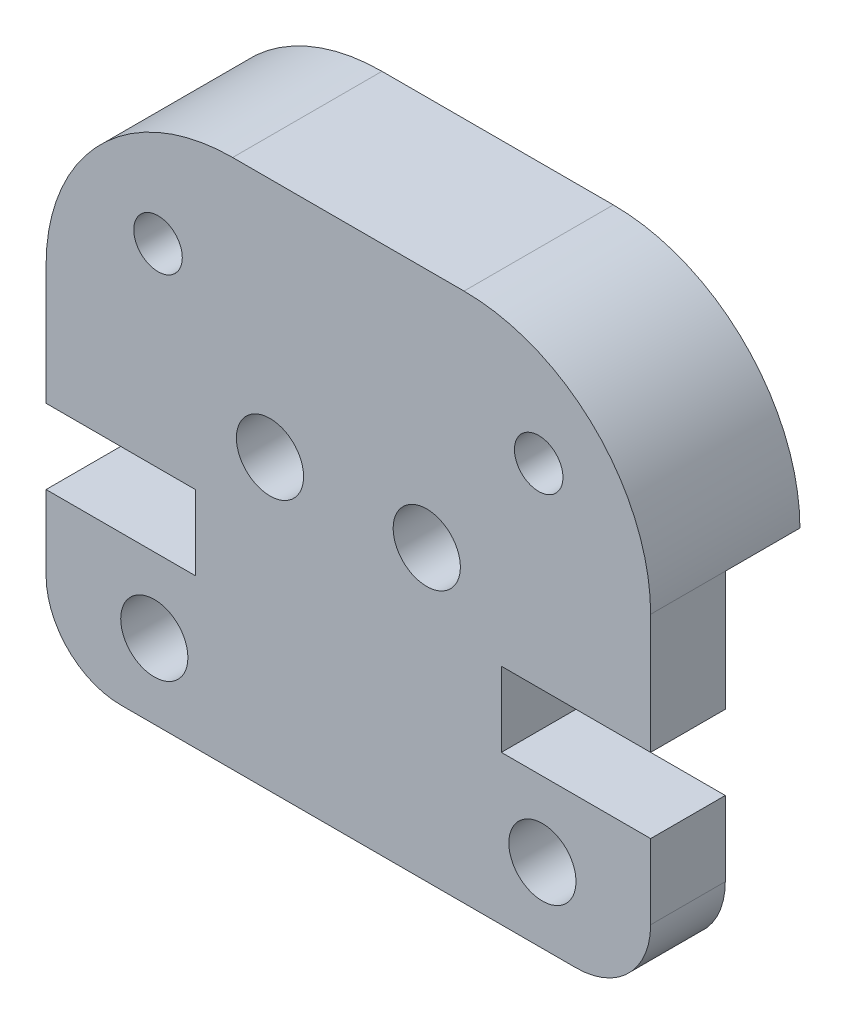
ISO-10303-21;
HEADER;
FILE_DESCRIPTION(('STEP AP214'),'2;1');
FILE_NAME('part.step','',(''),(''),'','','');
FILE_SCHEMA(('AUTOMOTIVE_DESIGN { 1 0 10303 214 1 1 1 1 }'));
ENDSEC;
DATA;
#1=APPLICATION_CONTEXT('core data for automotive mechanical design processes');
#2=APPLICATION_PROTOCOL_DEFINITION('international standard','automotive_design',2000,#1);
#3=PRODUCT_CONTEXT('',#1,'mechanical');
#4=PRODUCT('Part','Part','',(#3));
#5=PRODUCT_RELATED_PRODUCT_CATEGORY('part','',(#4));
#6=PRODUCT_DEFINITION_FORMATION('','',#4);
#7=PRODUCT_DEFINITION_CONTEXT('part definition',#1,'design');
#8=PRODUCT_DEFINITION('design','',#6,#7);
#9=PRODUCT_DEFINITION_SHAPE('','',#8);
#10=(LENGTH_UNIT() NAMED_UNIT(*) SI_UNIT(.MILLI.,.METRE.));
#11=(NAMED_UNIT(*) PLANE_ANGLE_UNIT() SI_UNIT($,.RADIAN.));
#12=(NAMED_UNIT(*) SI_UNIT($,.STERADIAN.) SOLID_ANGLE_UNIT());
#13=UNCERTAINTY_MEASURE_WITH_UNIT(LENGTH_MEASURE(1.E-05),#10,'distance_accuracy_value','');
#14=(GEOMETRIC_REPRESENTATION_CONTEXT(3) GLOBAL_UNCERTAINTY_ASSIGNED_CONTEXT((#13)) GLOBAL_UNIT_ASSIGNED_CONTEXT((#10,
#11,#12)) REPRESENTATION_CONTEXT('',''));
#15=CARTESIAN_POINT('',(0.,0.,0.));
#16=DIRECTION('',(0.,0.,1.));
#17=DIRECTION('',(1.,0.,0.));
#18=AXIS2_PLACEMENT_3D('',#15,#16,#17);
#19=CARTESIAN_POINT('',(14.2,2.00000000000002,4.));
#20=DIRECTION('',(0.,0.,-1.));
#21=DIRECTION('',(-1.,0.,0.));
#22=AXIS2_PLACEMENT_3D('',#19,#20,#21);
#23=CYLINDRICAL_SURFACE('',#22,2.00000000000001);
#24=CARTESIAN_POINT('',(14.2,2.00000000000002,2.));
#25=DIRECTION('',(0.,0.,-1.));
#26=DIRECTION('',(-1.,0.,0.));
#27=AXIS2_PLACEMENT_3D('',#24,#25,#26);
#28=CIRCLE('',#27,2.00000000000001);
#29=CARTESIAN_POINT('',(16.2,2.00000000000002,2.));
#30=VERTEX_POINT('',#29);
#31=CARTESIAN_POINT('',(14.2,0.,2.));
#32=VERTEX_POINT('',#31);
#33=EDGE_CURVE('E48',#30,#32,#28,.T.);
#34=ORIENTED_EDGE('',*,*,#33,.F.);
#35=DIRECTION('',(0.,0.,-1.));
#36=VECTOR('',#35,1.);
#37=CARTESIAN_POINT('',(16.2,2.00000000000002,4.));
#38=LINE('',#37,#36);
#39=CARTESIAN_POINT('',(16.2,2.00000000000002,4.));
#40=VERTEX_POINT('',#39);
#41=EDGE_CURVE('E11',#40,#30,#38,.T.);
#42=ORIENTED_EDGE('',*,*,#41,.F.);
#43=CARTESIAN_POINT('',(14.2,2.00000000000002,4.));
#44=DIRECTION('',(0.,0.,1.));
#45=DIRECTION('',(-1.,0.,0.));
#46=AXIS2_PLACEMENT_3D('',#43,#44,#45);
#47=CIRCLE('',#46,2.00000000000001);
#48=CARTESIAN_POINT('',(14.2,0.,4.));
#49=VERTEX_POINT('',#48);
#50=EDGE_CURVE('E159',#49,#40,#47,.T.);
#51=ORIENTED_EDGE('',*,*,#50,.F.);
#52=DIRECTION('',(0.,0.,-1.));
#53=VECTOR('',#52,1.);
#54=CARTESIAN_POINT('',(14.2,0.,4.));
#55=LINE('',#54,#53);
#56=EDGE_CURVE('E148',#49,#32,#55,.T.);
#57=ORIENTED_EDGE('',*,*,#56,.T.);
#58=EDGE_LOOP('',(#34,#42,#51,#57));
#59=FACE_BOUND('',#58,.T.);
#60=ADVANCED_FACE('F33',(#59),#23,.T.);
#61=CARTESIAN_POINT('',(16.2,2.00000000000002,4.));
#62=DIRECTION('',(-1.,0.,0.));
#63=DIRECTION('',(0.,0.,1.));
#64=AXIS2_PLACEMENT_3D('',#61,#62,#63);
#65=PLANE('',#64);
#66=DIRECTION('',(0.,-1.,0.));
#67=VECTOR('',#66,1.);
#68=CARTESIAN_POINT('',(16.2,9.205,2.));
#69=LINE('',#68,#67);
#70=CARTESIAN_POINT('',(16.2,4.00000000000002,2.));
#71=VERTEX_POINT('',#70);
#72=EDGE_CURVE('E207',#71,#30,#69,.T.);
#73=ORIENTED_EDGE('',*,*,#72,.F.);
#74=DIRECTION('',(0.,0.,-1.));
#75=VECTOR('',#74,1.);
#76=CARTESIAN_POINT('',(16.2,4.00000000000002,4.));
#77=LINE('',#76,#75);
#78=CARTESIAN_POINT('',(16.2,4.00000000000002,4.));
#79=VERTEX_POINT('',#78);
#80=EDGE_CURVE('E41',#79,#71,#77,.T.);
#81=ORIENTED_EDGE('',*,*,#80,.F.);
#82=DIRECTION('',(0.,1.,0.));
#83=VECTOR('',#82,1.);
#84=CARTESIAN_POINT('',(16.2,2.00000000000002,4.));
#85=LINE('',#84,#83);
#86=EDGE_CURVE('E81',#40,#79,#85,.T.);
#87=ORIENTED_EDGE('',*,*,#86,.F.);
#88=ORIENTED_EDGE('',*,*,#41,.T.);
#89=EDGE_LOOP('',(#73,#81,#87,#88));
#90=FACE_BOUND('',#89,.T.);
#91=ADVANCED_FACE('F206',(#90),#65,.F.);
#92=CARTESIAN_POINT('',(12.2,4.00000000000002,4.));
#93=DIRECTION('',(0.,-1.,0.));
#94=DIRECTION('',(1.,0.,0.));
#95=AXIS2_PLACEMENT_3D('',#92,#93,#94);
#96=PLANE('',#95);
#97=DIRECTION('',(1.,0.,0.));
#98=VECTOR('',#97,1.);
#99=CARTESIAN_POINT('',(12.2,4.00000000000002,2.));
#100=LINE('',#99,#98);
#101=CARTESIAN_POINT('',(12.2,4.00000000000002,2.));
#102=VERTEX_POINT('',#101);
#103=EDGE_CURVE('E200',#102,#71,#100,.T.);
#104=ORIENTED_EDGE('',*,*,#103,.F.);
#105=DIRECTION('',(0.,0.,-1.));
#106=VECTOR('',#105,1.);
#107=CARTESIAN_POINT('',(12.2,4.00000000000002,4.));
#108=LINE('',#107,#106);
#109=CARTESIAN_POINT('',(12.2,4.00000000000002,4.));
#110=VERTEX_POINT('',#109);
#111=EDGE_CURVE('E189',#110,#102,#108,.T.);
#112=ORIENTED_EDGE('',*,*,#111,.F.);
#113=DIRECTION('',(-1.,0.,0.));
#114=VECTOR('',#113,1.);
#115=CARTESIAN_POINT('',(12.2,4.00000000000002,4.));
#116=LINE('',#115,#114);
#117=EDGE_CURVE('E201',#79,#110,#116,.T.);
#118=ORIENTED_EDGE('',*,*,#117,.F.);
#119=ORIENTED_EDGE('',*,*,#80,.T.);
#120=EDGE_LOOP('',(#104,#112,#118,#119));
#121=FACE_BOUND('',#120,.T.);
#122=ADVANCED_FACE('F197',(#121),#96,.F.);
#123=CARTESIAN_POINT('',(12.2,6.00000000000003,4.));
#124=DIRECTION('',(-1.,0.,0.));
#125=DIRECTION('',(0.,-1.,0.));
#126=AXIS2_PLACEMENT_3D('',#123,#124,#125);
#127=PLANE('',#126);
#128=DIRECTION('',(0.,-1.,0.));
#129=VECTOR('',#128,1.);
#130=CARTESIAN_POINT('',(12.2,6.00000000000003,2.));
#131=LINE('',#130,#129);
#132=CARTESIAN_POINT('',(12.2,6.00000000000003,2.));
#133=VERTEX_POINT('',#132);
#134=EDGE_CURVE('E251',#133,#102,#131,.T.);
#135=ORIENTED_EDGE('',*,*,#134,.F.);
#136=DIRECTION('',(0.,0.,-1.));
#137=VECTOR('',#136,1.);
#138=CARTESIAN_POINT('',(12.2,6.00000000000003,4.));
#139=LINE('',#138,#137);
#140=CARTESIAN_POINT('',(12.2,6.00000000000003,4.));
#141=VERTEX_POINT('',#140);
#142=EDGE_CURVE('E186',#141,#133,#139,.T.);
#143=ORIENTED_EDGE('',*,*,#142,.F.);
#144=DIRECTION('',(0.,1.,0.));
#145=VECTOR('',#144,1.);
#146=CARTESIAN_POINT('',(12.2,6.00000000000003,4.));
#147=LINE('',#146,#145);
#148=EDGE_CURVE('E282',#110,#141,#147,.T.);
#149=ORIENTED_EDGE('',*,*,#148,.F.);
#150=ORIENTED_EDGE('',*,*,#111,.T.);
#151=EDGE_LOOP('',(#135,#143,#149,#150));
#152=FACE_BOUND('',#151,.T.);
#153=ADVANCED_FACE('F325',(#152),#127,.F.);
#154=CARTESIAN_POINT('',(16.2,6.00000000000003,4.));
#155=DIRECTION('',(0.,1.,0.));
#156=DIRECTION('',(-1.,0.,0.));
#157=AXIS2_PLACEMENT_3D('',#154,#155,#156);
#158=PLANE('',#157);
#159=DIRECTION('',(-1.,0.,0.));
#160=VECTOR('',#159,1.);
#161=CARTESIAN_POINT('',(16.2,6.00000000000003,2.));
#162=LINE('',#161,#160);
#163=CARTESIAN_POINT('',(16.2,6.00000000000003,2.));
#164=VERTEX_POINT('',#163);
#165=EDGE_CURVE('E248',#164,#133,#162,.T.);
#166=ORIENTED_EDGE('',*,*,#165,.F.);
#167=DIRECTION('',(0.,0.,-1.));
#168=VECTOR('',#167,1.);
#169=CARTESIAN_POINT('',(16.2,6.00000000000003,4.));
#170=LINE('',#169,#168);
#171=CARTESIAN_POINT('',(16.2,6.00000000000003,4.));
#172=VERTEX_POINT('',#171);
#173=EDGE_CURVE('E183',#172,#164,#170,.T.);
#174=ORIENTED_EDGE('',*,*,#173,.F.);
#175=DIRECTION('',(1.,0.,0.));
#176=VECTOR('',#175,1.);
#177=CARTESIAN_POINT('',(16.2,6.00000000000003,4.));
#178=LINE('',#177,#176);
#179=EDGE_CURVE('E284',#141,#172,#178,.T.);
#180=ORIENTED_EDGE('',*,*,#179,.F.);
#181=ORIENTED_EDGE('',*,*,#142,.T.);
#182=EDGE_LOOP('',(#166,#174,#180,#181));
#183=FACE_BOUND('',#182,.T.);
#184=ADVANCED_FACE('F329',(#183),#158,.F.);
#185=CARTESIAN_POINT('',(16.2,9.205,4.));
#186=DIRECTION('',(-1.,0.,0.));
#187=DIRECTION('',(0.,-1.,0.));
#188=AXIS2_PLACEMENT_3D('',#185,#186,#187);
#189=PLANE('',#188);
#190=CARTESIAN_POINT('',(16.2,9.205,2.));
#191=VERTEX_POINT('',#190);
#192=EDGE_CURVE('E209',#191,#164,#69,.T.);
#193=ORIENTED_EDGE('',*,*,#192,.F.);
#194=DIRECTION('',(0.,0.,-1.));
#195=VECTOR('',#194,1.);
#196=CARTESIAN_POINT('',(16.2,9.205,4.));
#197=LINE('',#196,#195);
#198=CARTESIAN_POINT('',(16.2,9.205,4.));
#199=VERTEX_POINT('',#198);
#200=EDGE_CURVE('E180',#199,#191,#197,.T.);
#201=ORIENTED_EDGE('',*,*,#200,.F.);
#202=DIRECTION('',(0.,1.,0.));
#203=VECTOR('',#202,1.);
#204=CARTESIAN_POINT('',(16.2,9.205,4.));
#205=LINE('',#204,#203);
#206=EDGE_CURVE('E286',#172,#199,#205,.T.);
#207=ORIENTED_EDGE('',*,*,#206,.F.);
#208=ORIENTED_EDGE('',*,*,#173,.T.);
#209=EDGE_LOOP('',(#193,#201,#207,#208));
#210=FACE_BOUND('',#209,.T.);
#211=ADVANCED_FACE('F376',(#210),#189,.F.);
#212=CARTESIAN_POINT('',(0.,9.20499999999999,4.));
#213=DIRECTION('',(1.,0.,0.));
#214=DIRECTION('',(0.,0.,-1.));
#215=AXIS2_PLACEMENT_3D('',#212,#213,#214);
#216=PLANE('',#215);
#217=DIRECTION('',(0.,1.,0.));
#218=VECTOR('',#217,1.);
#219=CARTESIAN_POINT('',(0.,0.,2.));
#220=LINE('',#219,#218);
#221=CARTESIAN_POINT('',(0.,6.00000000000003,2.));
#222=VERTEX_POINT('',#221);
#223=CARTESIAN_POINT('',(0.,9.20499999999999,2.));
#224=VERTEX_POINT('',#223);
#225=EDGE_CURVE('E349',#222,#224,#220,.T.);
#226=ORIENTED_EDGE('',*,*,#225,.F.);
#227=DIRECTION('',(0.,0.,-1.));
#228=VECTOR('',#227,1.);
#229=CARTESIAN_POINT('',(0.,6.00000000000003,4.));
#230=LINE('',#229,#228);
#231=CARTESIAN_POINT('',(0.,6.00000000000003,4.));
#232=VERTEX_POINT('',#231);
#233=EDGE_CURVE('E170',#232,#222,#230,.T.);
#234=ORIENTED_EDGE('',*,*,#233,.F.);
#235=DIRECTION('',(0.,-1.,0.));
#236=VECTOR('',#235,1.);
#237=CARTESIAN_POINT('',(0.,9.20499999999999,4.));
#238=LINE('',#237,#236);
#239=CARTESIAN_POINT('',(0.,9.20499999999999,4.));
#240=VERTEX_POINT('',#239);
#241=EDGE_CURVE('E294',#240,#232,#238,.T.);
#242=ORIENTED_EDGE('',*,*,#241,.F.);
#243=DIRECTION('',(0.,0.,-1.));
#244=VECTOR('',#243,1.);
#245=CARTESIAN_POINT('',(0.,9.20499999999999,4.));
#246=LINE('',#245,#244);
#247=EDGE_CURVE('E173',#240,#224,#246,.T.);
#248=ORIENTED_EDGE('',*,*,#247,.T.);
#249=EDGE_LOOP('',(#226,#234,#242,#248));
#250=FACE_BOUND('',#249,.T.);
#251=ADVANCED_FACE('F365',(#250),#216,.F.);
#252=CARTESIAN_POINT('',(0.,6.00000000000003,4.));
#253=DIRECTION('',(0.,1.,0.));
#254=DIRECTION('',(-1.,0.,0.));
#255=AXIS2_PLACEMENT_3D('',#252,#253,#254);
#256=PLANE('',#255);
#257=DIRECTION('',(-1.,0.,0.));
#258=VECTOR('',#257,1.);
#259=CARTESIAN_POINT('',(0.,6.00000000000003,2.));
#260=LINE('',#259,#258);
#261=CARTESIAN_POINT('',(4.00000000000001,6.00000000000003,2.));
#262=VERTEX_POINT('',#261);
#263=EDGE_CURVE('E245',#262,#222,#260,.T.);
#264=ORIENTED_EDGE('',*,*,#263,.F.);
#265=DIRECTION('',(0.,0.,-1.));
#266=VECTOR('',#265,1.);
#267=CARTESIAN_POINT('',(4.00000000000001,6.00000000000003,4.));
#268=LINE('',#267,#266);
#269=CARTESIAN_POINT('',(4.00000000000001,6.00000000000003,4.));
#270=VERTEX_POINT('',#269);
#271=EDGE_CURVE('E167',#270,#262,#268,.T.);
#272=ORIENTED_EDGE('',*,*,#271,.F.);
#273=DIRECTION('',(1.,0.,0.));
#274=VECTOR('',#273,1.);
#275=CARTESIAN_POINT('',(0.,6.00000000000003,4.));
#276=LINE('',#275,#274);
#277=EDGE_CURVE('E296',#232,#270,#276,.T.);
#278=ORIENTED_EDGE('',*,*,#277,.F.);
#279=ORIENTED_EDGE('',*,*,#233,.T.);
#280=EDGE_LOOP('',(#264,#272,#278,#279));
#281=FACE_BOUND('',#280,.T.);
#282=ADVANCED_FACE('F383',(#281),#256,.F.);
#283=CARTESIAN_POINT('',(4.00000000000001,6.00000000000003,4.));
#284=DIRECTION('',(1.,0.,0.));
#285=DIRECTION('',(0.,0.,-1.));
#286=AXIS2_PLACEMENT_3D('',#283,#284,#285);
#287=PLANE('',#286);
#288=DIRECTION('',(0.,1.,0.));
#289=VECTOR('',#288,1.);
#290=CARTESIAN_POINT('',(4.00000000000001,6.00000000000003,2.));
#291=LINE('',#290,#289);
#292=CARTESIAN_POINT('',(4.00000000000001,4.00000000000002,2.));
#293=VERTEX_POINT('',#292);
#294=EDGE_CURVE('E242',#293,#262,#291,.T.);
#295=ORIENTED_EDGE('',*,*,#294,.F.);
#296=DIRECTION('',(0.,0.,-1.));
#297=VECTOR('',#296,1.);
#298=CARTESIAN_POINT('',(4.00000000000001,4.00000000000002,4.));
#299=LINE('',#298,#297);
#300=CARTESIAN_POINT('',(4.00000000000001,4.00000000000002,4.));
#301=VERTEX_POINT('',#300);
#302=EDGE_CURVE('E164',#301,#293,#299,.T.);
#303=ORIENTED_EDGE('',*,*,#302,.F.);
#304=DIRECTION('',(0.,-1.,0.));
#305=VECTOR('',#304,1.);
#306=CARTESIAN_POINT('',(4.00000000000001,6.00000000000003,4.));
#307=LINE('',#306,#305);
#308=EDGE_CURVE('E298',#270,#301,#307,.T.);
#309=ORIENTED_EDGE('',*,*,#308,.F.);
#310=ORIENTED_EDGE('',*,*,#271,.T.);
#311=EDGE_LOOP('',(#295,#303,#309,#310));
#312=FACE_BOUND('',#311,.T.);
#313=ADVANCED_FACE('F305',(#312),#287,.F.);
#314=CARTESIAN_POINT('',(4.00000000000001,4.00000000000002,4.));
#315=DIRECTION('',(0.,-1.,0.));
#316=DIRECTION('',(1.,0.,0.));
#317=AXIS2_PLACEMENT_3D('',#314,#315,#316);
#318=PLANE('',#317);
#319=DIRECTION('',(1.,0.,0.));
#320=VECTOR('',#319,1.);
#321=CARTESIAN_POINT('',(4.00000000000001,4.00000000000002,2.));
#322=LINE('',#321,#320);
#323=CARTESIAN_POINT('',(0.,4.00000000000003,2.));
#324=VERTEX_POINT('',#323);
#325=EDGE_CURVE('E239',#324,#293,#322,.T.);
#326=ORIENTED_EDGE('',*,*,#325,.F.);
#327=DIRECTION('',(0.,0.,-1.));
#328=VECTOR('',#327,1.);
#329=CARTESIAN_POINT('',(0.,4.00000000000003,4.));
#330=LINE('',#329,#328);
#331=CARTESIAN_POINT('',(0.,4.00000000000003,4.));
#332=VERTEX_POINT('',#331);
#333=EDGE_CURVE('E142',#332,#324,#330,.T.);
#334=ORIENTED_EDGE('',*,*,#333,.F.);
#335=DIRECTION('',(-1.,0.,0.));
#336=VECTOR('',#335,1.);
#337=CARTESIAN_POINT('',(4.00000000000001,4.00000000000002,4.));
#338=LINE('',#337,#336);
#339=EDGE_CURVE('E128',#301,#332,#338,.T.);
#340=ORIENTED_EDGE('',*,*,#339,.F.);
#341=ORIENTED_EDGE('',*,*,#302,.T.);
#342=EDGE_LOOP('',(#326,#334,#340,#341));
#343=FACE_BOUND('',#342,.T.);
#344=ADVANCED_FACE('F309',(#343),#318,.F.);
#345=CARTESIAN_POINT('',(0.,2.00000000000001,4.));
#346=DIRECTION('',(1.,0.,0.));
#347=DIRECTION('',(0.,0.,-1.));
#348=AXIS2_PLACEMENT_3D('',#345,#346,#347);
#349=PLANE('',#348);
#350=CARTESIAN_POINT('',(0.,2.00000000000001,2.));
#351=VERTEX_POINT('',#350);
#352=EDGE_CURVE('E139',#351,#324,#220,.T.);
#353=ORIENTED_EDGE('',*,*,#352,.F.);
#354=DIRECTION('',(0.,0.,-1.));
#355=VECTOR('',#354,1.);
#356=CARTESIAN_POINT('',(0.,2.00000000000001,4.));
#357=LINE('',#356,#355);
#358=CARTESIAN_POINT('',(0.,2.00000000000001,4.));
#359=VERTEX_POINT('',#358);
#360=EDGE_CURVE('E135',#359,#351,#357,.T.);
#361=ORIENTED_EDGE('',*,*,#360,.F.);
#362=DIRECTION('',(0.,-1.,0.));
#363=VECTOR('',#362,1.);
#364=CARTESIAN_POINT('',(0.,2.00000000000001,4.));
#365=LINE('',#364,#363);
#366=EDGE_CURVE('E120',#332,#359,#365,.T.);
#367=ORIENTED_EDGE('',*,*,#366,.F.);
#368=ORIENTED_EDGE('',*,*,#333,.T.);
#369=EDGE_LOOP('',(#353,#361,#367,#368));
#370=FACE_BOUND('',#369,.T.);
#371=ADVANCED_FACE('F136',(#370),#349,.F.);
#372=CARTESIAN_POINT('',(2.,2.00000000000001,4.));
#373=DIRECTION('',(0.,0.,-1.));
#374=DIRECTION('',(-1.,0.,0.));
#375=AXIS2_PLACEMENT_3D('',#372,#373,#374);
#376=CYLINDRICAL_SURFACE('',#375,2.00000000000001);
#377=CARTESIAN_POINT('',(2.,2.00000000000001,2.));
#378=DIRECTION('',(0.,0.,-1.));
#379=DIRECTION('',(-1.,0.,0.));
#380=AXIS2_PLACEMENT_3D('',#377,#378,#379);
#381=CIRCLE('',#380,2.00000000000001);
#382=CARTESIAN_POINT('',(2.,0.,2.));
#383=VERTEX_POINT('',#382);
#384=EDGE_CURVE('E236',#383,#351,#381,.T.);
#385=ORIENTED_EDGE('',*,*,#384,.F.);
#386=DIRECTION('',(0.,0.,-1.));
#387=VECTOR('',#386,1.);
#388=CARTESIAN_POINT('',(2.,0.,4.));
#389=LINE('',#388,#387);
#390=CARTESIAN_POINT('',(2.,0.,4.));
#391=VERTEX_POINT('',#390);
#392=EDGE_CURVE('E143',#391,#383,#389,.T.);
#393=ORIENTED_EDGE('',*,*,#392,.F.);
#394=CARTESIAN_POINT('',(2.,2.00000000000001,4.));
#395=DIRECTION('',(0.,0.,1.));
#396=DIRECTION('',(1.,0.,0.));
#397=AXIS2_PLACEMENT_3D('',#394,#395,#396);
#398=CIRCLE('',#397,2.00000000000001);
#399=EDGE_CURVE('E125',#359,#391,#398,.T.);
#400=ORIENTED_EDGE('',*,*,#399,.F.);
#401=ORIENTED_EDGE('',*,*,#360,.T.);
#402=EDGE_LOOP('',(#385,#393,#400,#401));
#403=FACE_BOUND('',#402,.T.);
#404=ADVANCED_FACE('F145',(#403),#376,.T.);
#405=CARTESIAN_POINT('',(2.,0.,4.));
#406=DIRECTION('',(0.,1.,0.));
#407=DIRECTION('',(-1.,0.,0.));
#408=AXIS2_PLACEMENT_3D('',#405,#406,#407);
#409=PLANE('',#408);
#410=DIRECTION('',(-1.,0.,0.));
#411=VECTOR('',#410,1.);
#412=CARTESIAN_POINT('',(16.2,0.,2.));
#413=LINE('',#412,#411);
#414=EDGE_CURVE('E221',#32,#383,#413,.T.);
#415=ORIENTED_EDGE('',*,*,#414,.F.);
#416=ORIENTED_EDGE('',*,*,#56,.F.);
#417=DIRECTION('',(1.,0.,0.));
#418=VECTOR('',#417,1.);
#419=CARTESIAN_POINT('',(2.,0.,4.));
#420=LINE('',#419,#418);
#421=EDGE_CURVE('E57',#391,#49,#420,.T.);
#422=ORIENTED_EDGE('',*,*,#421,.F.);
#423=ORIENTED_EDGE('',*,*,#392,.T.);
#424=EDGE_LOOP('',(#415,#416,#422,#423));
#425=FACE_BOUND('',#424,.T.);
#426=ADVANCED_FACE('F457',(#425),#409,.F.);
#427=CARTESIAN_POINT('',(13.3,2.00000000000002,4.));
#428=DIRECTION('',(0.,0.,-1.));
#429=DIRECTION('',(-1.,0.,0.));
#430=AXIS2_PLACEMENT_3D('',#427,#428,#429);
#431=CYLINDRICAL_SURFACE('',#430,0.9);
#432=CARTESIAN_POINT('',(13.3,2.00000000000002,4.));
#433=DIRECTION('',(0.,0.,1.));
#434=DIRECTION('',(-1.,0.,0.));
#435=AXIS2_PLACEMENT_3D('',#432,#433,#434);
#436=CIRCLE('',#435,0.9);
#437=CARTESIAN_POINT('',(12.4,2.00000000000002,4.));
#438=VERTEX_POINT('',#437);
#439=EDGE_CURVE('E154',#438,#438,#436,.T.);
#440=ORIENTED_EDGE('',*,*,#439,.T.);
#441=EDGE_LOOP('',(#440));
#442=FACE_BOUND('',#441,.T.);
#443=CARTESIAN_POINT('',(13.3,2.00000000000002,2.));
#444=DIRECTION('',(0.,0.,-1.));
#445=DIRECTION('',(-1.,0.,0.));
#446=AXIS2_PLACEMENT_3D('',#443,#444,#445);
#447=CIRCLE('',#446,0.9);
#448=CARTESIAN_POINT('',(12.4,2.00000000000002,2.));
#449=VERTEX_POINT('',#448);
#450=EDGE_CURVE('E233',#449,#449,#447,.T.);
#451=ORIENTED_EDGE('',*,*,#450,.T.);
#452=EDGE_LOOP('',(#451));
#453=FACE_BOUND('',#452,.T.);
#454=ADVANCED_FACE('F466',(#442,#453),#431,.F.);
#455=CARTESIAN_POINT('',(10.2000000000053,7.75,4.));
#456=DIRECTION('',(0.,0.,-1.));
#457=DIRECTION('',(-1.,0.,0.));
#458=AXIS2_PLACEMENT_3D('',#455,#456,#457);
#459=CYLINDRICAL_SURFACE('',#458,0.9);
#460=CARTESIAN_POINT('',(10.2000000000053,7.75,4.));
#461=DIRECTION('',(0.,0.,1.));
#462=DIRECTION('',(-1.,0.,0.));
#463=AXIS2_PLACEMENT_3D('',#460,#461,#462);
#464=CIRCLE('',#463,0.9);
#465=CARTESIAN_POINT('',(9.30000000000532,7.75,4.));
#466=VERTEX_POINT('',#465);
#467=EDGE_CURVE('E268',#466,#466,#464,.T.);
#468=ORIENTED_EDGE('',*,*,#467,.T.);
#469=EDGE_LOOP('',(#468));
#470=FACE_BOUND('',#469,.T.);
#471=CARTESIAN_POINT('',(10.2000000000053,7.75,2.));
#472=DIRECTION('',(0.,0.,-1.));
#473=DIRECTION('',(-1.,0.,0.));
#474=AXIS2_PLACEMENT_3D('',#471,#472,#473);
#475=CIRCLE('',#474,0.9);
#476=CARTESIAN_POINT('',(9.30000000000532,7.75,2.));
#477=VERTEX_POINT('',#476);
#478=EDGE_CURVE('E230',#477,#477,#475,.T.);
#479=ORIENTED_EDGE('',*,*,#478,.T.);
#480=EDGE_LOOP('',(#479));
#481=FACE_BOUND('',#480,.T.);
#482=ADVANCED_FACE('F476',(#470,#481),#459,.F.);
#483=CARTESIAN_POINT('',(5.99999999999468,7.75,4.));
#484=DIRECTION('',(0.,0.,-1.));
#485=DIRECTION('',(-1.,0.,0.));
#486=AXIS2_PLACEMENT_3D('',#483,#484,#485);
#487=CYLINDRICAL_SURFACE('',#486,0.899999999999999);
#488=CARTESIAN_POINT('',(5.99999999999468,7.75,4.));
#489=DIRECTION('',(0.,0.,1.));
#490=DIRECTION('',(1.,0.,0.));
#491=AXIS2_PLACEMENT_3D('',#488,#489,#490);
#492=CIRCLE('',#491,0.899999999999999);
#493=CARTESIAN_POINT('',(6.89999999999467,7.75,4.));
#494=VERTEX_POINT('',#493);
#495=EDGE_CURVE('E263',#494,#494,#492,.T.);
#496=ORIENTED_EDGE('',*,*,#495,.T.);
#497=EDGE_LOOP('',(#496));
#498=FACE_BOUND('',#497,.T.);
#499=CARTESIAN_POINT('',(5.99999999999468,7.75,2.));
#500=DIRECTION('',(0.,0.,-1.));
#501=DIRECTION('',(-1.,0.,0.));
#502=AXIS2_PLACEMENT_3D('',#499,#500,#501);
#503=CIRCLE('',#502,0.899999999999999);
#504=CARTESIAN_POINT('',(5.09999999999468,7.75,2.));
#505=VERTEX_POINT('',#504);
#506=EDGE_CURVE('E227',#505,#505,#503,.T.);
#507=ORIENTED_EDGE('',*,*,#506,.T.);
#508=EDGE_LOOP('',(#507));
#509=FACE_BOUND('',#508,.T.);
#510=ADVANCED_FACE('F486',(#498,#509),#487,.F.);
#511=CARTESIAN_POINT('',(2.9,2.00000000000002,4.));
#512=DIRECTION('',(0.,0.,-1.));
#513=DIRECTION('',(-1.,0.,0.));
#514=AXIS2_PLACEMENT_3D('',#511,#512,#513);
#515=CYLINDRICAL_SURFACE('',#514,0.9);
#516=CARTESIAN_POINT('',(2.9,2.00000000000002,4.));
#517=DIRECTION('',(0.,0.,1.));
#518=DIRECTION('',(1.,0.,0.));
#519=AXIS2_PLACEMENT_3D('',#516,#517,#518);
#520=CIRCLE('',#519,0.9);
#521=CARTESIAN_POINT('',(3.8,2.00000000000002,4.));
#522=VERTEX_POINT('',#521);
#523=EDGE_CURVE('E256',#522,#522,#520,.T.);
#524=ORIENTED_EDGE('',*,*,#523,.T.);
#525=EDGE_LOOP('',(#524));
#526=FACE_BOUND('',#525,.T.);
#527=CARTESIAN_POINT('',(2.9,2.00000000000002,2.));
#528=DIRECTION('',(0.,0.,-1.));
#529=DIRECTION('',(-1.,0.,0.));
#530=AXIS2_PLACEMENT_3D('',#527,#528,#529);
#531=CIRCLE('',#530,0.9);
#532=CARTESIAN_POINT('',(2.,2.00000000000002,2.));
#533=VERTEX_POINT('',#532);
#534=EDGE_CURVE('E36',#533,#533,#531,.T.);
#535=ORIENTED_EDGE('',*,*,#534,.T.);
#536=EDGE_LOOP('',(#535));
#537=FACE_BOUND('',#536,.T.);
#538=ADVANCED_FACE('F496',(#526,#537),#515,.F.);
#539=CARTESIAN_POINT('',(14.2,2.00000000000002,4.));
#540=DIRECTION('',(0.,0.,-1.));
#541=DIRECTION('',(-1.,0.,0.));
#542=AXIS2_PLACEMENT_3D('',#539,#540,#541);
#543=PLANE('',#542);
#544=CARTESIAN_POINT('',(3.00000000000434,11.2049999999999,4.));
#545=DIRECTION('',(0.,0.,1.));
#546=DIRECTION('',(1.,0.,0.));
#547=AXIS2_PLACEMENT_3D('',#544,#545,#546);
#548=CIRCLE('',#547,0.65);
#549=CARTESIAN_POINT('',(3.65000000000434,11.2049999999999,4.));
#550=VERTEX_POINT('',#549);
#551=EDGE_CURVE('E260',#550,#550,#548,.T.);
#552=ORIENTED_EDGE('',*,*,#551,.F.);
#553=EDGE_LOOP('',(#552));
#554=FACE_BOUND('',#553,.T.);
#555=ORIENTED_EDGE('',*,*,#467,.F.);
#556=EDGE_LOOP('',(#555));
#557=FACE_BOUND('',#556,.T.);
#558=ORIENTED_EDGE('',*,*,#439,.F.);
#559=EDGE_LOOP('',(#558));
#560=FACE_BOUND('',#559,.T.);
#561=ORIENTED_EDGE('',*,*,#50,.T.);
#562=ORIENTED_EDGE('',*,*,#86,.T.);
#563=ORIENTED_EDGE('',*,*,#117,.T.);
#564=ORIENTED_EDGE('',*,*,#148,.T.);
#565=ORIENTED_EDGE('',*,*,#179,.T.);
#566=ORIENTED_EDGE('',*,*,#206,.T.);
#567=CARTESIAN_POINT('',(11.2,9.20499999999999,4.));
#568=DIRECTION('',(0.,0.,1.));
#569=DIRECTION('',(-1.,0.,0.));
#570=AXIS2_PLACEMENT_3D('',#567,#568,#569);
#571=CIRCLE('',#570,5.);
#572=CARTESIAN_POINT('',(11.2,14.205,4.));
#573=VERTEX_POINT('',#572);
#574=EDGE_CURVE('E288',#199,#573,#571,.T.);
#575=ORIENTED_EDGE('',*,*,#574,.T.);
#576=DIRECTION('',(-1.,0.,0.));
#577=VECTOR('',#576,1.);
#578=CARTESIAN_POINT('',(5.,14.205,4.));
#579=LINE('',#578,#577);
#580=CARTESIAN_POINT('',(5.,14.205,4.));
#581=VERTEX_POINT('',#580);
#582=EDGE_CURVE('E290',#573,#581,#579,.T.);
#583=ORIENTED_EDGE('',*,*,#582,.T.);
#584=CARTESIAN_POINT('',(5.,9.20499999999999,4.));
#585=DIRECTION('',(0.,0.,1.));
#586=DIRECTION('',(1.,0.,0.));
#587=AXIS2_PLACEMENT_3D('',#584,#585,#586);
#588=CIRCLE('',#587,5.);
#589=EDGE_CURVE('E292',#581,#240,#588,.T.);
#590=ORIENTED_EDGE('',*,*,#589,.T.);
#591=ORIENTED_EDGE('',*,*,#241,.T.);
#592=ORIENTED_EDGE('',*,*,#277,.T.);
#593=ORIENTED_EDGE('',*,*,#308,.T.);
#594=ORIENTED_EDGE('',*,*,#339,.T.);
#595=ORIENTED_EDGE('',*,*,#366,.T.);
#596=ORIENTED_EDGE('',*,*,#399,.T.);
#597=ORIENTED_EDGE('',*,*,#421,.T.);
#598=EDGE_LOOP('',(#561,#562,#563,#564,#565,#566,#575,#583,#590,#591,#592,#593,#594,#595,#596,#597));
#599=FACE_BOUND('',#598,.T.);
#600=CARTESIAN_POINT('',(13.1999999999957,11.2049999999999,4.));
#601=DIRECTION('',(0.,0.,1.));
#602=DIRECTION('',(-1.,0.,0.));
#603=AXIS2_PLACEMENT_3D('',#600,#601,#602);
#604=CIRCLE('',#603,0.649999999999999);
#605=CARTESIAN_POINT('',(12.5499999999957,11.2049999999999,4.));
#606=VERTEX_POINT('',#605);
#607=EDGE_CURVE('E272',#606,#606,#604,.T.);
#608=ORIENTED_EDGE('',*,*,#607,.F.);
#609=EDGE_LOOP('',(#608));
#610=FACE_BOUND('',#609,.T.);
#611=ORIENTED_EDGE('',*,*,#495,.F.);
#612=EDGE_LOOP('',(#611));
#613=FACE_BOUND('',#612,.T.);
#614=ORIENTED_EDGE('',*,*,#523,.F.);
#615=EDGE_LOOP('',(#614));
#616=FACE_BOUND('',#615,.T.);
#617=ADVANCED_FACE('F122',(#554,#557,#560,#599,#610,#613,#616),#543,.F.);
#618=CARTESIAN_POINT('',(14.2,2.00000000000002,0.));
#619=DIRECTION('',(0.,0.,-1.));
#620=DIRECTION('',(-1.,0.,0.));
#621=AXIS2_PLACEMENT_3D('',#618,#619,#620);
#622=PLANE('',#621);
#623=DIRECTION('',(1.,0.,0.));
#624=VECTOR('',#623,1.);
#625=CARTESIAN_POINT('',(0.,9.20499999999999,0.));
#626=LINE('',#625,#624);
#627=CARTESIAN_POINT('',(0.,9.20499999999999,0.));
#628=VERTEX_POINT('',#627);
#629=CARTESIAN_POINT('',(16.2,9.205,0.));
#630=VERTEX_POINT('',#629);
#631=EDGE_CURVE('E218',#628,#630,#626,.T.);
#632=ORIENTED_EDGE('',*,*,#631,.F.);
#633=CARTESIAN_POINT('',(5.,9.20499999999999,0.));
#634=DIRECTION('',(0.,0.,1.));
#635=DIRECTION('',(1.,0.,0.));
#636=AXIS2_PLACEMENT_3D('',#633,#634,#635);
#637=CIRCLE('',#636,5.);
#638=CARTESIAN_POINT('',(5.,14.205,0.));
#639=VERTEX_POINT('',#638);
#640=EDGE_CURVE('E156',#639,#628,#637,.T.);
#641=ORIENTED_EDGE('',*,*,#640,.F.);
#642=DIRECTION('',(-1.,0.,0.));
#643=VECTOR('',#642,1.);
#644=CARTESIAN_POINT('',(5.,14.205,0.));
#645=LINE('',#644,#643);
#646=CARTESIAN_POINT('',(11.2,14.205,0.));
#647=VERTEX_POINT('',#646);
#648=EDGE_CURVE('E73',#647,#639,#645,.T.);
#649=ORIENTED_EDGE('',*,*,#648,.F.);
#650=CARTESIAN_POINT('',(11.2,9.20499999999999,0.));
#651=DIRECTION('',(0.,0.,1.));
#652=DIRECTION('',(-1.,0.,0.));
#653=AXIS2_PLACEMENT_3D('',#650,#651,#652);
#654=CIRCLE('',#653,5.);
#655=EDGE_CURVE('E152',#630,#647,#654,.T.);
#656=ORIENTED_EDGE('',*,*,#655,.F.);
#657=EDGE_LOOP('',(#632,#641,#649,#656));
#658=FACE_BOUND('',#657,.T.);
#659=CARTESIAN_POINT('',(3.00000000000434,11.2049999999999,0.));
#660=DIRECTION('',(0.,0.,1.));
#661=DIRECTION('',(1.,0.,0.));
#662=AXIS2_PLACEMENT_3D('',#659,#660,#661);
#663=CIRCLE('',#662,0.65);
#664=CARTESIAN_POINT('',(3.65000000000434,11.2049999999999,0.));
#665=VERTEX_POINT('',#664);
#666=EDGE_CURVE('E259',#665,#665,#663,.T.);
#667=ORIENTED_EDGE('',*,*,#666,.T.);
#668=EDGE_LOOP('',(#667));
#669=FACE_BOUND('',#668,.T.);
#670=CARTESIAN_POINT('',(13.1999999999957,11.2049999999999,0.));
#671=DIRECTION('',(0.,0.,1.));
#672=DIRECTION('',(-1.,0.,0.));
#673=AXIS2_PLACEMENT_3D('',#670,#671,#672);
#674=CIRCLE('',#673,0.649999999999999);
#675=CARTESIAN_POINT('',(12.5499999999957,11.2049999999999,0.));
#676=VERTEX_POINT('',#675);
#677=EDGE_CURVE('E271',#676,#676,#674,.T.);
#678=ORIENTED_EDGE('',*,*,#677,.T.);
#679=EDGE_LOOP('',(#678));
#680=FACE_BOUND('',#679,.T.);
#681=ADVANCED_FACE('F368',(#658,#669,#680),#622,.T.);
#682=CARTESIAN_POINT('',(11.2,9.20499999999999,4.));
#683=DIRECTION('',(0.,0.,-1.));
#684=DIRECTION('',(-1.,0.,0.));
#685=AXIS2_PLACEMENT_3D('',#682,#683,#684);
#686=CYLINDRICAL_SURFACE('',#685,5.);
#687=ORIENTED_EDGE('',*,*,#655,.T.);
#688=DIRECTION('',(0.,0.,-1.));
#689=VECTOR('',#688,1.);
#690=CARTESIAN_POINT('',(11.2,14.205,4.));
#691=LINE('',#690,#689);
#692=EDGE_CURVE('E178',#573,#647,#691,.T.);
#693=ORIENTED_EDGE('',*,*,#692,.F.);
#694=ORIENTED_EDGE('',*,*,#574,.F.);
#695=ORIENTED_EDGE('',*,*,#200,.T.);
#696=DIRECTION('',(0.,0.,-1.));
#697=VECTOR('',#696,1.);
#698=CARTESIAN_POINT('',(16.2,9.205,2.));
#699=LINE('',#698,#697);
#700=EDGE_CURVE('E222',#191,#630,#699,.T.);
#701=ORIENTED_EDGE('',*,*,#700,.T.);
#702=EDGE_LOOP('',(#687,#693,#694,#695,#701));
#703=FACE_BOUND('',#702,.T.);
#704=ADVANCED_FACE('F372',(#703),#686,.T.);
#705=CARTESIAN_POINT('',(5.,14.205,4.));
#706=DIRECTION('',(0.,-1.,0.));
#707=DIRECTION('',(0.,0.,-1.));
#708=AXIS2_PLACEMENT_3D('',#705,#706,#707);
#709=PLANE('',#708);
#710=ORIENTED_EDGE('',*,*,#648,.T.);
#711=DIRECTION('',(0.,0.,-1.));
#712=VECTOR('',#711,1.);
#713=CARTESIAN_POINT('',(5.,14.205,4.));
#714=LINE('',#713,#712);
#715=EDGE_CURVE('E176',#581,#639,#714,.T.);
#716=ORIENTED_EDGE('',*,*,#715,.F.);
#717=ORIENTED_EDGE('',*,*,#582,.F.);
#718=ORIENTED_EDGE('',*,*,#692,.T.);
#719=EDGE_LOOP('',(#710,#716,#717,#718));
#720=FACE_BOUND('',#719,.T.);
#721=ADVANCED_FACE('F526',(#720),#709,.F.);
#722=CARTESIAN_POINT('',(5.,9.20499999999999,4.));
#723=DIRECTION('',(0.,0.,-1.));
#724=DIRECTION('',(-1.,0.,0.));
#725=AXIS2_PLACEMENT_3D('',#722,#723,#724);
#726=CYLINDRICAL_SURFACE('',#725,5.);
#727=ORIENTED_EDGE('',*,*,#640,.T.);
#728=DIRECTION('',(0.,0.,-1.));
#729=VECTOR('',#728,1.);
#730=CARTESIAN_POINT('',(0.,9.20499999999999,2.));
#731=LINE('',#730,#729);
#732=EDGE_CURVE('E213',#224,#628,#731,.T.);
#733=ORIENTED_EDGE('',*,*,#732,.F.);
#734=ORIENTED_EDGE('',*,*,#247,.F.);
#735=ORIENTED_EDGE('',*,*,#589,.F.);
#736=ORIENTED_EDGE('',*,*,#715,.T.);
#737=EDGE_LOOP('',(#727,#733,#734,#735,#736));
#738=FACE_BOUND('',#737,.T.);
#739=ADVANCED_FACE('F361',(#738),#726,.T.);
#740=CARTESIAN_POINT('',(13.1999999999957,11.2049999999999,4.));
#741=DIRECTION('',(0.,0.,-1.));
#742=DIRECTION('',(-1.,0.,0.));
#743=AXIS2_PLACEMENT_3D('',#740,#741,#742);
#744=CYLINDRICAL_SURFACE('',#743,0.649999999999999);
#745=ORIENTED_EDGE('',*,*,#607,.T.);
#746=EDGE_LOOP('',(#745));
#747=FACE_BOUND('',#746,.T.);
#748=ORIENTED_EDGE('',*,*,#677,.F.);
#749=EDGE_LOOP('',(#748));
#750=FACE_BOUND('',#749,.T.);
#751=ADVANCED_FACE('F536',(#747,#750),#744,.F.);
#752=CARTESIAN_POINT('',(3.00000000000434,11.2049999999999,4.));
#753=DIRECTION('',(0.,0.,-1.));
#754=DIRECTION('',(-1.,0.,0.));
#755=AXIS2_PLACEMENT_3D('',#752,#753,#754);
#756=CYLINDRICAL_SURFACE('',#755,0.65);
#757=ORIENTED_EDGE('',*,*,#551,.T.);
#758=EDGE_LOOP('',(#757));
#759=FACE_BOUND('',#758,.T.);
#760=ORIENTED_EDGE('',*,*,#666,.F.);
#761=EDGE_LOOP('',(#760));
#762=FACE_BOUND('',#761,.T.);
#763=ADVANCED_FACE('F547',(#759,#762),#756,.F.);
#764=CARTESIAN_POINT('',(0.,0.,2.));
#765=DIRECTION('',(0.,0.,-1.));
#766=DIRECTION('',(-1.,0.,0.));
#767=AXIS2_PLACEMENT_3D('',#764,#765,#766);
#768=PLANE('',#767);
#769=ORIENTED_EDGE('',*,*,#450,.F.);
#770=EDGE_LOOP('',(#769));
#771=FACE_BOUND('',#770,.T.);
#772=ORIENTED_EDGE('',*,*,#478,.F.);
#773=EDGE_LOOP('',(#772));
#774=FACE_BOUND('',#773,.T.);
#775=ORIENTED_EDGE('',*,*,#506,.F.);
#776=EDGE_LOOP('',(#775));
#777=FACE_BOUND('',#776,.T.);
#778=ORIENTED_EDGE('',*,*,#534,.F.);
#779=EDGE_LOOP('',(#778));
#780=FACE_BOUND('',#779,.T.);
#781=ORIENTED_EDGE('',*,*,#33,.T.);
#782=ORIENTED_EDGE('',*,*,#414,.T.);
#783=ORIENTED_EDGE('',*,*,#384,.T.);
#784=ORIENTED_EDGE('',*,*,#352,.T.);
#785=ORIENTED_EDGE('',*,*,#325,.T.);
#786=ORIENTED_EDGE('',*,*,#294,.T.);
#787=ORIENTED_EDGE('',*,*,#263,.T.);
#788=ORIENTED_EDGE('',*,*,#225,.T.);
#789=DIRECTION('',(1.,0.,0.));
#790=VECTOR('',#789,1.);
#791=CARTESIAN_POINT('',(0.,9.20499999999999,2.));
#792=LINE('',#791,#790);
#793=EDGE_CURVE('E210',#224,#191,#792,.T.);
#794=ORIENTED_EDGE('',*,*,#793,.T.);
#795=ORIENTED_EDGE('',*,*,#192,.T.);
#796=ORIENTED_EDGE('',*,*,#165,.T.);
#797=ORIENTED_EDGE('',*,*,#134,.T.);
#798=ORIENTED_EDGE('',*,*,#103,.T.);
#799=ORIENTED_EDGE('',*,*,#72,.T.);
#800=EDGE_LOOP('',(#781,#782,#783,#784,#785,#786,#787,#788,#794,#795,#796,#797,#798,#799));
#801=FACE_BOUND('',#800,.T.);
#802=ADVANCED_FACE('F322',(#771,#774,#777,#780,#801),#768,.T.);
#803=CARTESIAN_POINT('',(0.,9.20499999999999,2.));
#804=DIRECTION('',(0.,1.,0.));
#805=DIRECTION('',(-1.,0.,0.));
#806=AXIS2_PLACEMENT_3D('',#803,#804,#805);
#807=PLANE('',#806);
#808=ORIENTED_EDGE('',*,*,#631,.T.);
#809=ORIENTED_EDGE('',*,*,#700,.F.);
#810=ORIENTED_EDGE('',*,*,#793,.F.);
#811=ORIENTED_EDGE('',*,*,#732,.T.);
#812=EDGE_LOOP('',(#808,#809,#810,#811));
#813=FACE_BOUND('',#812,.T.);
#814=ADVANCED_FACE('F357',(#813),#807,.F.);
#815=CLOSED_SHELL('',(#60,#91,#122,#153,#184,#211,#251,#282,#313,#344,#371,#404,#426,#454,#482,
#510,#538,#617,#681,#704,#721,#739,#751,#763,#802,#814));
#816=MANIFOLD_SOLID_BREP('B2',#815);
#817=ADVANCED_BREP_SHAPE_REPRESENTATION('',(#18,#816),#14);
#818=SHAPE_DEFINITION_REPRESENTATION(#9,#817);
ENDSEC;
END-ISO-10303-21;
